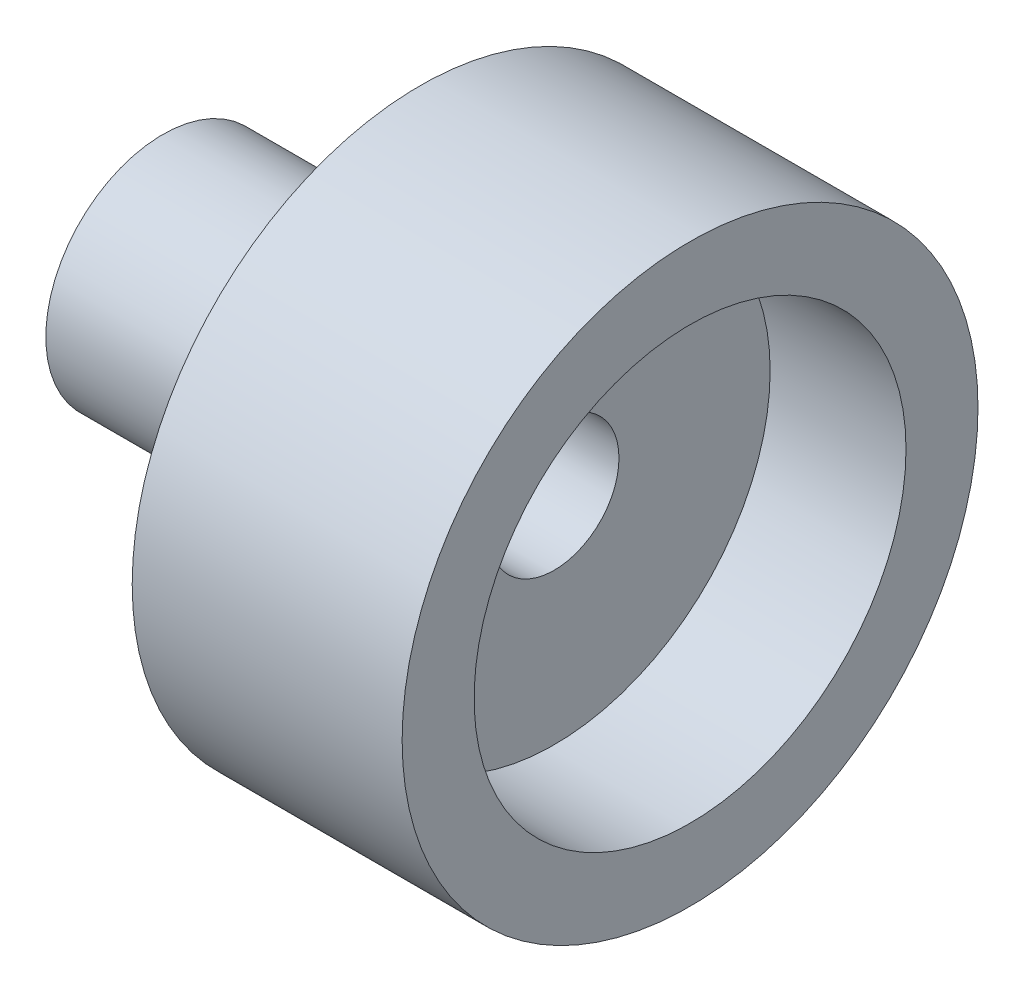
ISO-10303-21;
HEADER;
FILE_DESCRIPTION(('STEP AP214'),'2;1');
FILE_NAME('part.step','',(''),(''),'','','');
FILE_SCHEMA(('AUTOMOTIVE_DESIGN { 1 0 10303 214 1 1 1 1 }'));
ENDSEC;
DATA;
#1=APPLICATION_CONTEXT('core data for automotive mechanical design processes');
#2=APPLICATION_PROTOCOL_DEFINITION('international standard','automotive_design',2000,#1);
#3=PRODUCT_CONTEXT('',#1,'mechanical');
#4=PRODUCT('Part','Part','',(#3));
#5=PRODUCT_RELATED_PRODUCT_CATEGORY('part','',(#4));
#6=PRODUCT_DEFINITION_FORMATION('','',#4);
#7=PRODUCT_DEFINITION_CONTEXT('part definition',#1,'design');
#8=PRODUCT_DEFINITION('design','',#6,#7);
#9=PRODUCT_DEFINITION_SHAPE('','',#8);
#10=(LENGTH_UNIT() NAMED_UNIT(*) SI_UNIT(.MILLI.,.METRE.));
#11=(NAMED_UNIT(*) PLANE_ANGLE_UNIT() SI_UNIT($,.RADIAN.));
#12=(NAMED_UNIT(*) SI_UNIT($,.STERADIAN.) SOLID_ANGLE_UNIT());
#13=UNCERTAINTY_MEASURE_WITH_UNIT(LENGTH_MEASURE(1.E-05),#10,'distance_accuracy_value','');
#14=(GEOMETRIC_REPRESENTATION_CONTEXT(3) GLOBAL_UNCERTAINTY_ASSIGNED_CONTEXT((#13)) GLOBAL_UNIT_ASSIGNED_CONTEXT((#10,
#11,#12)) REPRESENTATION_CONTEXT('',''));
#15=CARTESIAN_POINT('',(0.,0.,0.));
#16=DIRECTION('',(0.,0.,1.));
#17=DIRECTION('',(1.,0.,0.));
#18=AXIS2_PLACEMENT_3D('',#15,#16,#17);
#19=CARTESIAN_POINT('',(7.5,0.,0.));
#20=DIRECTION('',(1.,0.,0.));
#21=DIRECTION('',(0.,0.,-1.));
#22=AXIS2_PLACEMENT_3D('',#19,#20,#21);
#23=PLANE('',#22);
#24=CARTESIAN_POINT('',(7.5,0.,0.));
#25=DIRECTION('',(1.,0.,0.));
#26=DIRECTION('',(0.,0.,-1.));
#27=AXIS2_PLACEMENT_3D('',#24,#25,#26);
#28=CIRCLE('',#27,6.);
#29=CARTESIAN_POINT('',(7.5,0.,-6.));
#30=VERTEX_POINT('',#29);
#31=EDGE_CURVE('E50',#30,#30,#28,.T.);
#32=ORIENTED_EDGE('',*,*,#31,.F.);
#33=EDGE_LOOP('',(#32));
#34=FACE_BOUND('',#33,.T.);
#35=CARTESIAN_POINT('',(7.5,0.,0.));
#36=DIRECTION('',(1.,0.,0.));
#37=DIRECTION('',(0.,0.,-1.));
#38=AXIS2_PLACEMENT_3D('',#35,#36,#37);
#39=CIRCLE('',#38,8.);
#40=CARTESIAN_POINT('',(7.5,0.,-8.));
#41=VERTEX_POINT('',#40);
#42=EDGE_CURVE('E10',#41,#41,#39,.T.);
#43=ORIENTED_EDGE('',*,*,#42,.T.);
#44=EDGE_LOOP('',(#43));
#45=FACE_BOUND('',#44,.T.);
#46=ADVANCED_FACE('F37',(#34,#45),#23,.T.);
#47=CARTESIAN_POINT('',(0.,0.,0.));
#48=DIRECTION('',(1.,0.,0.));
#49=DIRECTION('',(0.,0.,-1.));
#50=AXIS2_PLACEMENT_3D('',#47,#48,#49);
#51=PLANE('',#50);
#52=CARTESIAN_POINT('',(0.,0.,0.));
#53=DIRECTION('',(1.,0.,0.));
#54=DIRECTION('',(0.,0.,-1.));
#55=AXIS2_PLACEMENT_3D('',#52,#53,#54);
#56=CIRCLE('',#55,8.);
#57=CARTESIAN_POINT('',(0.,0.,-8.));
#58=VERTEX_POINT('',#57);
#59=EDGE_CURVE('E41',#58,#58,#56,.T.);
#60=ORIENTED_EDGE('',*,*,#59,.F.);
#61=EDGE_LOOP('',(#60));
#62=FACE_BOUND('',#61,.T.);
#63=CARTESIAN_POINT('',(0.,0.,0.));
#64=DIRECTION('',(1.,0.,0.));
#65=DIRECTION('',(0.,0.,-1.));
#66=AXIS2_PLACEMENT_3D('',#63,#64,#65);
#67=CIRCLE('',#66,3.25);
#68=CARTESIAN_POINT('',(0.,0.,-3.25));
#69=VERTEX_POINT('',#68);
#70=EDGE_CURVE('E53',#69,#69,#67,.T.);
#71=ORIENTED_EDGE('',*,*,#70,.T.);
#72=EDGE_LOOP('',(#71));
#73=FACE_BOUND('',#72,.T.);
#74=ADVANCED_FACE('F92',(#62,#73),#51,.F.);
#75=CARTESIAN_POINT('',(7.5,0.,0.));
#76=DIRECTION('',(-1.,0.,0.));
#77=DIRECTION('',(0.,0.,1.));
#78=AXIS2_PLACEMENT_3D('',#75,#76,#77);
#79=CYLINDRICAL_SURFACE('',#78,8.);
#80=ORIENTED_EDGE('',*,*,#42,.F.);
#81=EDGE_LOOP('',(#80));
#82=FACE_BOUND('',#81,.T.);
#83=ORIENTED_EDGE('',*,*,#59,.T.);
#84=EDGE_LOOP('',(#83));
#85=FACE_BOUND('',#84,.T.);
#86=ADVANCED_FACE('F39',(#82,#85),#79,.T.);
#87=CARTESIAN_POINT('',(3.725,0.,0.));
#88=DIRECTION('',(1.,0.,0.));
#89=DIRECTION('',(0.,0.,-1.));
#90=AXIS2_PLACEMENT_3D('',#87,#88,#89);
#91=CYLINDRICAL_SURFACE('',#90,6.);
#92=CARTESIAN_POINT('',(3.725,0.,0.));
#93=DIRECTION('',(1.,0.,0.));
#94=DIRECTION('',(0.,0.,-1.));
#95=AXIS2_PLACEMENT_3D('',#92,#93,#94);
#96=CIRCLE('',#95,6.);
#97=CARTESIAN_POINT('',(3.725,0.,-6.));
#98=VERTEX_POINT('',#97);
#99=EDGE_CURVE('E48',#98,#98,#96,.T.);
#100=ORIENTED_EDGE('',*,*,#99,.F.);
#101=EDGE_LOOP('',(#100));
#102=FACE_BOUND('',#101,.T.);
#103=ORIENTED_EDGE('',*,*,#31,.T.);
#104=EDGE_LOOP('',(#103));
#105=FACE_BOUND('',#104,.T.);
#106=ADVANCED_FACE('F80',(#102,#105),#91,.F.);
#107=CARTESIAN_POINT('',(3.725,0.,0.));
#108=DIRECTION('',(1.,0.,0.));
#109=DIRECTION('',(0.,0.,-1.));
#110=AXIS2_PLACEMENT_3D('',#107,#108,#109);
#111=PLANE('',#110);
#112=ORIENTED_EDGE('',*,*,#99,.T.);
#113=EDGE_LOOP('',(#112));
#114=FACE_BOUND('',#113,.T.);
#115=CARTESIAN_POINT('',(3.725,0.,0.));
#116=DIRECTION('',(1.,0.,0.));
#117=DIRECTION('',(0.,0.,-1.));
#118=AXIS2_PLACEMENT_3D('',#115,#116,#117);
#119=CIRCLE('',#118,1.8);
#120=CARTESIAN_POINT('',(3.725,0.,-1.8));
#121=VERTEX_POINT('',#120);
#122=EDGE_CURVE('E62',#121,#121,#119,.T.);
#123=ORIENTED_EDGE('',*,*,#122,.F.);
#124=EDGE_LOOP('',(#123));
#125=FACE_BOUND('',#124,.T.);
#126=ADVANCED_FACE('F77',(#114,#125),#111,.T.);
#127=CARTESIAN_POINT('',(-7.15,0.,0.));
#128=DIRECTION('',(1.,0.,0.));
#129=DIRECTION('',(0.,0.,-1.));
#130=AXIS2_PLACEMENT_3D('',#127,#128,#129);
#131=CYLINDRICAL_SURFACE('',#130,3.25);
#132=CARTESIAN_POINT('',(-7.15,0.,0.));
#133=DIRECTION('',(1.,0.,0.));
#134=DIRECTION('',(0.,0.,-1.));
#135=AXIS2_PLACEMENT_3D('',#132,#133,#134);
#136=CIRCLE('',#135,3.25);
#137=CARTESIAN_POINT('',(-7.15,0.,-3.25));
#138=VERTEX_POINT('',#137);
#139=EDGE_CURVE('E58',#138,#138,#136,.T.);
#140=ORIENTED_EDGE('',*,*,#139,.T.);
#141=EDGE_LOOP('',(#140));
#142=FACE_BOUND('',#141,.T.);
#143=ORIENTED_EDGE('',*,*,#70,.F.);
#144=EDGE_LOOP('',(#143));
#145=FACE_BOUND('',#144,.T.);
#146=ADVANCED_FACE('F79',(#142,#145),#131,.T.);
#147=CARTESIAN_POINT('',(-7.15,0.,0.));
#148=DIRECTION('',(1.,0.,0.));
#149=DIRECTION('',(0.,0.,-1.));
#150=AXIS2_PLACEMENT_3D('',#147,#148,#149);
#151=PLANE('',#150);
#152=CARTESIAN_POINT('',(-7.15,0.,0.));
#153=DIRECTION('',(1.,0.,0.));
#154=DIRECTION('',(0.,0.,-1.));
#155=AXIS2_PLACEMENT_3D('',#152,#153,#154);
#156=CIRCLE('',#155,1.8);
#157=CARTESIAN_POINT('',(-7.15,0.,-1.8));
#158=VERTEX_POINT('',#157);
#159=EDGE_CURVE('E61',#158,#158,#156,.T.);
#160=ORIENTED_EDGE('',*,*,#159,.T.);
#161=EDGE_LOOP('',(#160));
#162=FACE_BOUND('',#161,.T.);
#163=ORIENTED_EDGE('',*,*,#139,.F.);
#164=EDGE_LOOP('',(#163));
#165=FACE_BOUND('',#164,.T.);
#166=ADVANCED_FACE('F68',(#162,#165),#151,.F.);
#167=CARTESIAN_POINT('',(-7.15,0.,0.));
#168=DIRECTION('',(1.,0.,0.));
#169=DIRECTION('',(0.,0.,-1.));
#170=AXIS2_PLACEMENT_3D('',#167,#168,#169);
#171=CYLINDRICAL_SURFACE('',#170,1.8);
#172=ORIENTED_EDGE('',*,*,#159,.F.);
#173=EDGE_LOOP('',(#172));
#174=FACE_BOUND('',#173,.T.);
#175=ORIENTED_EDGE('',*,*,#122,.T.);
#176=EDGE_LOOP('',(#175));
#177=FACE_BOUND('',#176,.T.);
#178=ADVANCED_FACE('F71',(#174,#177),#171,.F.);
#179=CLOSED_SHELL('',(#46,#74,#86,#106,#126,#146,#166,#178));
#180=MANIFOLD_SOLID_BREP('B2',#179);
#181=ADVANCED_BREP_SHAPE_REPRESENTATION('',(#18,#180),#14);
#182=SHAPE_DEFINITION_REPRESENTATION(#9,#181);
ENDSEC;
END-ISO-10303-21;
